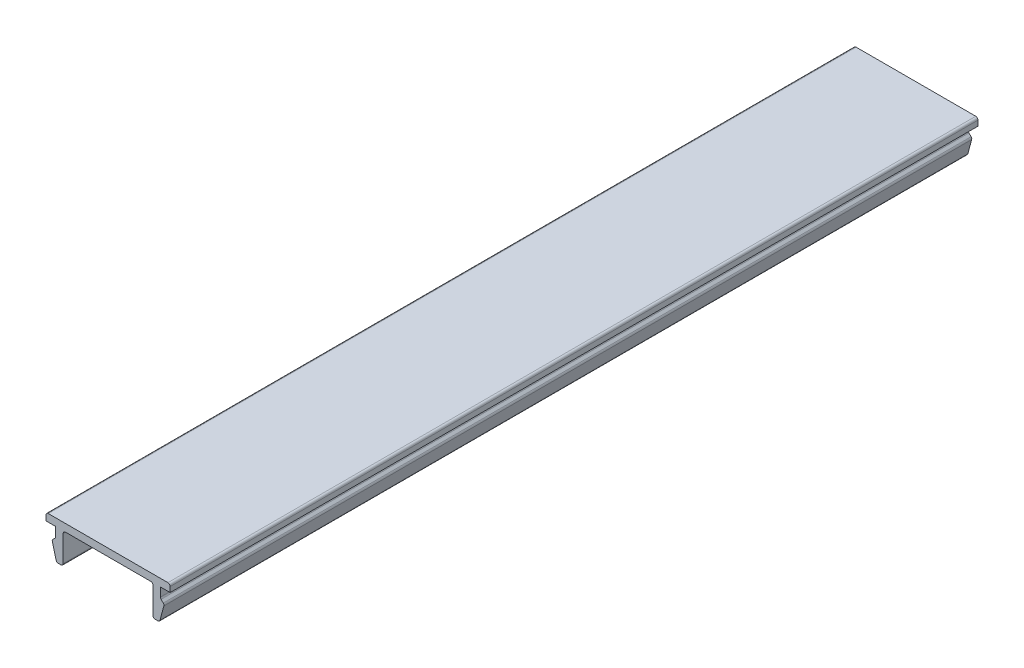
ISO-10303-21;
HEADER;
FILE_DESCRIPTION(('STEP AP214'),'2;1');
FILE_NAME('part.step','',(''),(''),'','','');
FILE_SCHEMA(('AUTOMOTIVE_DESIGN { 1 0 10303 214 1 1 1 1 }'));
ENDSEC;
DATA;
#1=APPLICATION_CONTEXT('core data for automotive mechanical design processes');
#2=APPLICATION_PROTOCOL_DEFINITION('international standard','automotive_design',2000,#1);
#3=PRODUCT_CONTEXT('',#1,'mechanical');
#4=PRODUCT('Part','Part','',(#3));
#5=PRODUCT_RELATED_PRODUCT_CATEGORY('part','',(#4));
#6=PRODUCT_DEFINITION_FORMATION('','',#4);
#7=PRODUCT_DEFINITION_CONTEXT('part definition',#1,'design');
#8=PRODUCT_DEFINITION('design','',#6,#7);
#9=PRODUCT_DEFINITION_SHAPE('','',#8);
#10=(LENGTH_UNIT() NAMED_UNIT(*) SI_UNIT(.MILLI.,.METRE.));
#11=(NAMED_UNIT(*) PLANE_ANGLE_UNIT() SI_UNIT($,.RADIAN.));
#12=(NAMED_UNIT(*) SI_UNIT($,.STERADIAN.) SOLID_ANGLE_UNIT());
#13=UNCERTAINTY_MEASURE_WITH_UNIT(LENGTH_MEASURE(1.E-05),#10,'distance_accuracy_value','');
#14=(GEOMETRIC_REPRESENTATION_CONTEXT(3) GLOBAL_UNCERTAINTY_ASSIGNED_CONTEXT((#13)) GLOBAL_UNIT_ASSIGNED_CONTEXT((#10,
#11,#12)) REPRESENTATION_CONTEXT('',''));
#15=CARTESIAN_POINT('',(0.,0.,0.));
#16=DIRECTION('',(0.,0.,1.));
#17=DIRECTION('',(1.,0.,0.));
#18=AXIS2_PLACEMENT_3D('',#15,#16,#17);
#19=CARTESIAN_POINT('',(-8.3,1.,108.));
#20=DIRECTION('',(1.,0.,0.));
#21=DIRECTION('',(0.,0.,-1.));
#22=AXIS2_PLACEMENT_3D('',#19,#20,#21);
#23=PLANE('',#22);
#24=DIRECTION('',(0.,-1.,0.));
#25=VECTOR('',#24,1.);
#26=CARTESIAN_POINT('',(-8.3,1.,108.));
#27=LINE('',#26,#25);
#28=CARTESIAN_POINT('',(-8.3,0.7,108.));
#29=VERTEX_POINT('',#28);
#30=CARTESIAN_POINT('',(-8.3,0.,108.));
#31=VERTEX_POINT('',#30);
#32=EDGE_CURVE('E224',#29,#31,#27,.T.);
#33=ORIENTED_EDGE('',*,*,#32,.F.);
#34=DIRECTION('',(0.,0.,-1.));
#35=VECTOR('',#34,1.);
#36=CARTESIAN_POINT('',(-8.3,0.7,108.));
#37=LINE('',#36,#35);
#38=CARTESIAN_POINT('',(-8.3,0.7,0.));
#39=VERTEX_POINT('',#38);
#40=EDGE_CURVE('E387',#29,#39,#37,.T.);
#41=ORIENTED_EDGE('',*,*,#40,.T.);
#42=DIRECTION('',(0.,-1.,0.));
#43=VECTOR('',#42,1.);
#44=CARTESIAN_POINT('',(-8.3,1.,0.));
#45=LINE('',#44,#43);
#46=CARTESIAN_POINT('',(-8.3,0.,0.));
#47=VERTEX_POINT('',#46);
#48=EDGE_CURVE('E252',#39,#47,#45,.T.);
#49=ORIENTED_EDGE('',*,*,#48,.T.);
#50=DIRECTION('',(0.,0.,-1.));
#51=VECTOR('',#50,1.);
#52=CARTESIAN_POINT('',(-8.3,0.,108.));
#53=LINE('',#52,#51);
#54=EDGE_CURVE('E244',#31,#47,#53,.T.);
#55=ORIENTED_EDGE('',*,*,#54,.F.);
#56=EDGE_LOOP('',(#33,#41,#49,#55));
#57=FACE_BOUND('',#56,.T.);
#58=ADVANCED_FACE('F39',(#57),#23,.F.);
#59=CARTESIAN_POINT('',(-8.3,0.,108.));
#60=DIRECTION('',(0.,1.,0.));
#61=DIRECTION('',(0.,0.,1.));
#62=AXIS2_PLACEMENT_3D('',#59,#60,#61);
#63=PLANE('',#62);
#64=DIRECTION('',(1.,0.,0.));
#65=VECTOR('',#64,1.);
#66=CARTESIAN_POINT('',(-8.3,0.,0.));
#67=LINE('',#66,#65);
#68=CARTESIAN_POINT('',(-7.,0.,0.));
#69=VERTEX_POINT('',#68);
#70=EDGE_CURVE('E422',#47,#69,#67,.T.);
#71=ORIENTED_EDGE('',*,*,#70,.T.);
#72=DIRECTION('',(0.,0.,-1.));
#73=VECTOR('',#72,1.);
#74=CARTESIAN_POINT('',(-7.,0.,108.));
#75=LINE('',#74,#73);
#76=CARTESIAN_POINT('',(-7.,0.,108.));
#77=VERTEX_POINT('',#76);
#78=EDGE_CURVE('E246',#77,#69,#75,.T.);
#79=ORIENTED_EDGE('',*,*,#78,.F.);
#80=DIRECTION('',(1.,0.,0.));
#81=VECTOR('',#80,1.);
#82=CARTESIAN_POINT('',(-8.3,0.,108.));
#83=LINE('',#82,#81);
#84=EDGE_CURVE('E229',#31,#77,#83,.T.);
#85=ORIENTED_EDGE('',*,*,#84,.F.);
#86=ORIENTED_EDGE('',*,*,#54,.T.);
#87=EDGE_LOOP('',(#71,#79,#85,#86));
#88=FACE_BOUND('',#87,.T.);
#89=ADVANCED_FACE('F243',(#88),#63,.F.);
#90=CARTESIAN_POINT('',(-7.,0.,108.));
#91=DIRECTION('',(1.,0.,0.));
#92=DIRECTION('',(0.,0.,-1.));
#93=AXIS2_PLACEMENT_3D('',#90,#91,#92);
#94=PLANE('',#93);
#95=DIRECTION('',(0.,-1.,0.));
#96=VECTOR('',#95,1.);
#97=CARTESIAN_POINT('',(-7.,0.,0.));
#98=LINE('',#97,#96);
#99=CARTESIAN_POINT('',(-7.,-1.17573593128807,0.));
#100=VERTEX_POINT('',#99);
#101=EDGE_CURVE('E413',#69,#100,#98,.T.);
#102=ORIENTED_EDGE('',*,*,#101,.T.);
#103=DIRECTION('',(0.,0.,-1.));
#104=VECTOR('',#103,1.);
#105=CARTESIAN_POINT('',(-7.,-1.17573593128807,108.));
#106=LINE('',#105,#104);
#107=CARTESIAN_POINT('',(-7.,-1.17573593128807,108.));
#108=VERTEX_POINT('',#107);
#109=EDGE_CURVE('E384',#100,#108,#106,.F.);
#110=ORIENTED_EDGE('',*,*,#109,.T.);
#111=DIRECTION('',(0.,-1.,0.));
#112=VECTOR('',#111,1.);
#113=CARTESIAN_POINT('',(-7.,0.,108.));
#114=LINE('',#113,#112);
#115=EDGE_CURVE('E249',#77,#108,#114,.T.);
#116=ORIENTED_EDGE('',*,*,#115,.F.);
#117=ORIENTED_EDGE('',*,*,#78,.T.);
#118=EDGE_LOOP('',(#102,#110,#116,#117));
#119=FACE_BOUND('',#118,.T.);
#120=ADVANCED_FACE('F420',(#119),#94,.F.);
#121=CARTESIAN_POINT('',(-7.,-1.3,108.));
#122=DIRECTION('',(0.707106781186547,-0.707106781186548,0.));
#123=DIRECTION('',(0.707106781186548,0.707106781186547,0.));
#124=AXIS2_PLACEMENT_3D('',#121,#122,#123);
#125=PLANE('',#124);
#126=DIRECTION('',(-0.707106781186548,-0.707106781186547,0.));
#127=VECTOR('',#126,1.);
#128=CARTESIAN_POINT('',(-7.,-1.3,0.));
#129=LINE('',#128,#127);
#130=CARTESIAN_POINT('',(-7.08786796564404,-1.38786796564404,0.));
#131=VERTEX_POINT('',#130);
#132=CARTESIAN_POINT('',(-7.37752551286084,-1.67752551286084,0.));
#133=VERTEX_POINT('',#132);
#134=EDGE_CURVE('E415',#131,#133,#129,.T.);
#135=ORIENTED_EDGE('',*,*,#134,.T.);
#136=DIRECTION('',(0.,0.,-1.));
#137=VECTOR('',#136,1.);
#138=CARTESIAN_POINT('',(-7.37752551286084,-1.67752551286084,108.));
#139=LINE('',#138,#137);
#140=CARTESIAN_POINT('',(-7.37752551286084,-1.67752551286084,108.));
#141=VERTEX_POINT('',#140);
#142=EDGE_CURVE('E381',#133,#141,#139,.F.);
#143=ORIENTED_EDGE('',*,*,#142,.T.);
#144=DIRECTION('',(-0.707106781186548,-0.707106781186547,0.));
#145=VECTOR('',#144,1.);
#146=CARTESIAN_POINT('',(-7.,-1.3,108.));
#147=LINE('',#146,#145);
#148=CARTESIAN_POINT('',(-7.08786796564404,-1.38786796564404,108.));
#149=VERTEX_POINT('',#148);
#150=EDGE_CURVE('E428',#149,#141,#147,.T.);
#151=ORIENTED_EDGE('',*,*,#150,.F.);
#152=DIRECTION('',(0.,0.,-1.));
#153=VECTOR('',#152,1.);
#154=CARTESIAN_POINT('',(-7.08786796564404,-1.38786796564404,0.));
#155=LINE('',#154,#153);
#156=EDGE_CURVE('E377',#149,#131,#155,.T.);
#157=ORIENTED_EDGE('',*,*,#156,.T.);
#158=EDGE_LOOP('',(#135,#143,#151,#157));
#159=FACE_BOUND('',#158,.T.);
#160=ADVANCED_FACE('F431',(#159),#125,.F.);
#161=CARTESIAN_POINT('',(-7.5,-1.8,108.));
#162=DIRECTION('',(0.965925826289068,0.258819045102522,0.));
#163=DIRECTION('',(-0.258819045102522,0.965925826289068,0.));
#164=AXIS2_PLACEMENT_3D('',#161,#162,#163);
#165=PLANE('',#164);
#166=DIRECTION('',(0.258819045102522,-0.965925826289068,0.));
#167=VECTOR('',#166,1.);
#168=CARTESIAN_POINT('',(-7.5,-1.8,0.));
#169=LINE('',#168,#167);
#170=CARTESIAN_POINT('',(-7.4551712263916,-1.96730326074756,0.));
#171=VERTEX_POINT('',#170);
#172=CARTESIAN_POINT('',(-6.94329650890145,-3.87764571353076,0.));
#173=VERTEX_POINT('',#172);
#174=EDGE_CURVE('E488',#171,#173,#169,.T.);
#175=ORIENTED_EDGE('',*,*,#174,.T.);
#176=DIRECTION('',(0.,0.,-1.));
#177=VECTOR('',#176,1.);
#178=CARTESIAN_POINT('',(-6.94329650890145,-3.87764571353076,108.));
#179=LINE('',#178,#177);
#180=CARTESIAN_POINT('',(-6.94329650890145,-3.87764571353076,108.));
#181=VERTEX_POINT('',#180);
#182=EDGE_CURVE('E374',#173,#181,#179,.F.);
#183=ORIENTED_EDGE('',*,*,#182,.T.);
#184=DIRECTION('',(0.258819045102522,-0.965925826289068,0.));
#185=VECTOR('',#184,1.);
#186=CARTESIAN_POINT('',(-7.5,-1.8,108.));
#187=LINE('',#186,#185);
#188=CARTESIAN_POINT('',(-7.4551712263916,-1.96730326074756,108.));
#189=VERTEX_POINT('',#188);
#190=EDGE_CURVE('E434',#189,#181,#187,.T.);
#191=ORIENTED_EDGE('',*,*,#190,.F.);
#192=DIRECTION('',(0.,0.,-1.));
#193=VECTOR('',#192,1.);
#194=CARTESIAN_POINT('',(-7.4551712263916,-1.96730326074756,108.));
#195=LINE('',#194,#193);
#196=EDGE_CURVE('E370',#189,#171,#195,.T.);
#197=ORIENTED_EDGE('',*,*,#196,.T.);
#198=EDGE_LOOP('',(#175,#183,#191,#197));
#199=FACE_BOUND('',#198,.T.);
#200=ADVANCED_FACE('F613',(#199),#165,.F.);
#201=CARTESIAN_POINT('',(-6.,-4.1,108.));
#202=DIRECTION('',(0.,1.,0.));
#203=DIRECTION('',(0.,0.,1.));
#204=AXIS2_PLACEMENT_3D('',#201,#202,#203);
#205=PLANE('',#204);
#206=DIRECTION('',(1.,0.,0.));
#207=VECTOR('',#206,1.);
#208=CARTESIAN_POINT('',(-6.,-4.1,0.));
#209=LINE('',#208,#207);
#210=CARTESIAN_POINT('',(-6.65351876101473,-4.1,0.));
#211=VERTEX_POINT('',#210);
#212=CARTESIAN_POINT('',(-6.3,-4.1,0.));
#213=VERTEX_POINT('',#212);
#214=EDGE_CURVE('E492',#211,#213,#209,.T.);
#215=ORIENTED_EDGE('',*,*,#214,.T.);
#216=DIRECTION('',(0.,0.,-1.));
#217=VECTOR('',#216,1.);
#218=CARTESIAN_POINT('',(-6.3,-4.1,108.));
#219=LINE('',#218,#217);
#220=CARTESIAN_POINT('',(-6.3,-4.1,108.));
#221=VERTEX_POINT('',#220);
#222=EDGE_CURVE('E367',#213,#221,#219,.F.);
#223=ORIENTED_EDGE('',*,*,#222,.T.);
#224=DIRECTION('',(1.,0.,0.));
#225=VECTOR('',#224,1.);
#226=CARTESIAN_POINT('',(-6.,-4.1,108.));
#227=LINE('',#226,#225);
#228=CARTESIAN_POINT('',(-6.65351876101473,-4.1,108.));
#229=VERTEX_POINT('',#228);
#230=EDGE_CURVE('E439',#229,#221,#227,.T.);
#231=ORIENTED_EDGE('',*,*,#230,.F.);
#232=DIRECTION('',(0.,0.,-1.));
#233=VECTOR('',#232,1.);
#234=CARTESIAN_POINT('',(-6.65351876101473,-4.1,108.));
#235=LINE('',#234,#233);
#236=EDGE_CURVE('E363',#229,#211,#235,.T.);
#237=ORIENTED_EDGE('',*,*,#236,.T.);
#238=EDGE_LOOP('',(#215,#223,#231,#237));
#239=FACE_BOUND('',#238,.T.);
#240=ADVANCED_FACE('F620',(#239),#205,.F.);
#241=CARTESIAN_POINT('',(-6.,0.,108.));
#242=DIRECTION('',(-1.,0.,0.));
#243=DIRECTION('',(0.,-1.,0.));
#244=AXIS2_PLACEMENT_3D('',#241,#242,#243);
#245=PLANE('',#244);
#246=DIRECTION('',(0.,1.,0.));
#247=VECTOR('',#246,1.);
#248=CARTESIAN_POINT('',(-6.,0.,0.));
#249=LINE('',#248,#247);
#250=CARTESIAN_POINT('',(-6.,-3.8,0.));
#251=VERTEX_POINT('',#250);
#252=CARTESIAN_POINT('',(-6.,-0.3,0.));
#253=VERTEX_POINT('',#252);
#254=EDGE_CURVE('E496',#251,#253,#249,.T.);
#255=ORIENTED_EDGE('',*,*,#254,.T.);
#256=DIRECTION('',(0.,0.,-1.));
#257=VECTOR('',#256,1.);
#258=CARTESIAN_POINT('',(-6.,-0.3,108.));
#259=LINE('',#258,#257);
#260=CARTESIAN_POINT('',(-6.,-0.3,108.));
#261=VERTEX_POINT('',#260);
#262=EDGE_CURVE('E360',#253,#261,#259,.F.);
#263=ORIENTED_EDGE('',*,*,#262,.T.);
#264=DIRECTION('',(0.,1.,0.));
#265=VECTOR('',#264,1.);
#266=CARTESIAN_POINT('',(-6.,0.,108.));
#267=LINE('',#266,#265);
#268=CARTESIAN_POINT('',(-6.,-3.8,108.));
#269=VERTEX_POINT('',#268);
#270=EDGE_CURVE('E446',#269,#261,#267,.T.);
#271=ORIENTED_EDGE('',*,*,#270,.F.);
#272=DIRECTION('',(0.,0.,-1.));
#273=VECTOR('',#272,1.);
#274=CARTESIAN_POINT('',(-6.,-3.8,108.));
#275=LINE('',#274,#273);
#276=EDGE_CURVE('E356',#269,#251,#275,.T.);
#277=ORIENTED_EDGE('',*,*,#276,.T.);
#278=EDGE_LOOP('',(#255,#263,#271,#277));
#279=FACE_BOUND('',#278,.T.);
#280=ADVANCED_FACE('F627',(#279),#245,.F.);
#281=CARTESIAN_POINT('',(-6.,0.,108.));
#282=DIRECTION('',(0.,1.,0.));
#283=DIRECTION('',(0.,0.,1.));
#284=AXIS2_PLACEMENT_3D('',#281,#282,#283);
#285=PLANE('',#284);
#286=DIRECTION('',(1.,0.,0.));
#287=VECTOR('',#286,1.);
#288=CARTESIAN_POINT('',(-6.,0.,0.));
#289=LINE('',#288,#287);
#290=CARTESIAN_POINT('',(-5.7,0.,0.));
#291=VERTEX_POINT('',#290);
#292=CARTESIAN_POINT('',(5.69999999999999,0.,0.));
#293=VERTEX_POINT('',#292);
#294=EDGE_CURVE('E500',#291,#293,#289,.T.);
#295=ORIENTED_EDGE('',*,*,#294,.T.);
#296=DIRECTION('',(0.,0.,-1.));
#297=VECTOR('',#296,1.);
#298=CARTESIAN_POINT('',(5.69999999999999,0.,108.));
#299=LINE('',#298,#297);
#300=CARTESIAN_POINT('',(5.69999999999999,0.,108.));
#301=VERTEX_POINT('',#300);
#302=EDGE_CURVE('E353',#293,#301,#299,.F.);
#303=ORIENTED_EDGE('',*,*,#302,.T.);
#304=DIRECTION('',(1.,0.,0.));
#305=VECTOR('',#304,1.);
#306=CARTESIAN_POINT('',(-6.,0.,108.));
#307=LINE('',#306,#305);
#308=CARTESIAN_POINT('',(-5.7,0.,108.));
#309=VERTEX_POINT('',#308);
#310=EDGE_CURVE('E450',#309,#301,#307,.T.);
#311=ORIENTED_EDGE('',*,*,#310,.F.);
#312=DIRECTION('',(0.,0.,-1.));
#313=VECTOR('',#312,1.);
#314=CARTESIAN_POINT('',(-5.7,0.,0.));
#315=LINE('',#314,#313);
#316=EDGE_CURVE('E349',#309,#291,#315,.T.);
#317=ORIENTED_EDGE('',*,*,#316,.T.);
#318=EDGE_LOOP('',(#295,#303,#311,#317));
#319=FACE_BOUND('',#318,.T.);
#320=ADVANCED_FACE('F634',(#319),#285,.F.);
#321=CARTESIAN_POINT('',(5.99999999999999,0.,108.));
#322=DIRECTION('',(1.,0.,0.));
#323=DIRECTION('',(0.,1.,0.));
#324=AXIS2_PLACEMENT_3D('',#321,#322,#323);
#325=PLANE('',#324);
#326=DIRECTION('',(0.,-1.,0.));
#327=VECTOR('',#326,1.);
#328=CARTESIAN_POINT('',(5.99999999999999,0.,0.));
#329=LINE('',#328,#327);
#330=CARTESIAN_POINT('',(5.99999999999999,-0.3,0.));
#331=VERTEX_POINT('',#330);
#332=CARTESIAN_POINT('',(5.99999999999999,-3.8,0.));
#333=VERTEX_POINT('',#332);
#334=EDGE_CURVE('E504',#331,#333,#329,.T.);
#335=ORIENTED_EDGE('',*,*,#334,.T.);
#336=DIRECTION('',(0.,0.,-1.));
#337=VECTOR('',#336,1.);
#338=CARTESIAN_POINT('',(5.99999999999999,-3.8,108.));
#339=LINE('',#338,#337);
#340=CARTESIAN_POINT('',(5.99999999999999,-3.8,108.));
#341=VERTEX_POINT('',#340);
#342=EDGE_CURVE('E346',#333,#341,#339,.F.);
#343=ORIENTED_EDGE('',*,*,#342,.T.);
#344=DIRECTION('',(0.,-1.,0.));
#345=VECTOR('',#344,1.);
#346=CARTESIAN_POINT('',(5.99999999999999,0.,108.));
#347=LINE('',#346,#345);
#348=CARTESIAN_POINT('',(5.99999999999999,-0.3,108.));
#349=VERTEX_POINT('',#348);
#350=EDGE_CURVE('E454',#349,#341,#347,.T.);
#351=ORIENTED_EDGE('',*,*,#350,.F.);
#352=DIRECTION('',(0.,0.,-1.));
#353=VECTOR('',#352,1.);
#354=CARTESIAN_POINT('',(5.99999999999999,-0.3,0.));
#355=LINE('',#354,#353);
#356=EDGE_CURVE('E342',#349,#331,#355,.T.);
#357=ORIENTED_EDGE('',*,*,#356,.T.);
#358=EDGE_LOOP('',(#335,#343,#351,#357));
#359=FACE_BOUND('',#358,.T.);
#360=ADVANCED_FACE('F641',(#359),#325,.F.);
#361=CARTESIAN_POINT('',(5.99999999999999,-4.1,108.));
#362=DIRECTION('',(0.,1.,0.));
#363=DIRECTION('',(0.,0.,1.));
#364=AXIS2_PLACEMENT_3D('',#361,#362,#363);
#365=PLANE('',#364);
#366=DIRECTION('',(1.,0.,0.));
#367=VECTOR('',#366,1.);
#368=CARTESIAN_POINT('',(5.99999999999999,-4.1,0.));
#369=LINE('',#368,#367);
#370=CARTESIAN_POINT('',(6.29999999999999,-4.1,0.));
#371=VERTEX_POINT('',#370);
#372=CARTESIAN_POINT('',(6.65351876101472,-4.1,0.));
#373=VERTEX_POINT('',#372);
#374=EDGE_CURVE('E508',#371,#373,#369,.T.);
#375=ORIENTED_EDGE('',*,*,#374,.T.);
#376=DIRECTION('',(0.,0.,-1.));
#377=VECTOR('',#376,1.);
#378=CARTESIAN_POINT('',(6.65351876101472,-4.1,108.));
#379=LINE('',#378,#377);
#380=CARTESIAN_POINT('',(6.65351876101472,-4.1,108.));
#381=VERTEX_POINT('',#380);
#382=EDGE_CURVE('E339',#373,#381,#379,.F.);
#383=ORIENTED_EDGE('',*,*,#382,.T.);
#384=DIRECTION('',(1.,0.,0.));
#385=VECTOR('',#384,1.);
#386=CARTESIAN_POINT('',(5.99999999999999,-4.1,108.));
#387=LINE('',#386,#385);
#388=CARTESIAN_POINT('',(6.29999999999999,-4.1,108.));
#389=VERTEX_POINT('',#388);
#390=EDGE_CURVE('E458',#389,#381,#387,.T.);
#391=ORIENTED_EDGE('',*,*,#390,.F.);
#392=DIRECTION('',(0.,0.,-1.));
#393=VECTOR('',#392,1.);
#394=CARTESIAN_POINT('',(6.29999999999999,-4.1,108.));
#395=LINE('',#394,#393);
#396=EDGE_CURVE('E335',#389,#371,#395,.T.);
#397=ORIENTED_EDGE('',*,*,#396,.T.);
#398=EDGE_LOOP('',(#375,#383,#391,#397));
#399=FACE_BOUND('',#398,.T.);
#400=ADVANCED_FACE('F648',(#399),#365,.F.);
#401=CARTESIAN_POINT('',(7.49999999999999,-1.8,108.));
#402=DIRECTION('',(-0.965925826289068,0.258819045102522,0.));
#403=DIRECTION('',(-0.258819045102522,-0.965925826289068,0.));
#404=AXIS2_PLACEMENT_3D('',#401,#402,#403);
#405=PLANE('',#404);
#406=DIRECTION('',(0.258819045102522,0.965925826289068,0.));
#407=VECTOR('',#406,1.);
#408=CARTESIAN_POINT('',(7.49999999999999,-1.8,0.));
#409=LINE('',#408,#407);
#410=CARTESIAN_POINT('',(6.94329650890144,-3.87764571353075,0.));
#411=VERTEX_POINT('',#410);
#412=CARTESIAN_POINT('',(7.45517122639159,-1.96730326074756,0.));
#413=VERTEX_POINT('',#412);
#414=EDGE_CURVE('E512',#411,#413,#409,.T.);
#415=ORIENTED_EDGE('',*,*,#414,.T.);
#416=DIRECTION('',(0.,0.,-1.));
#417=VECTOR('',#416,1.);
#418=CARTESIAN_POINT('',(7.45517122639159,-1.96730326074756,108.));
#419=LINE('',#418,#417);
#420=CARTESIAN_POINT('',(7.45517122639159,-1.96730326074756,108.));
#421=VERTEX_POINT('',#420);
#422=EDGE_CURVE('E332',#413,#421,#419,.F.);
#423=ORIENTED_EDGE('',*,*,#422,.T.);
#424=DIRECTION('',(0.258819045102522,0.965925826289068,0.));
#425=VECTOR('',#424,1.);
#426=CARTESIAN_POINT('',(7.49999999999999,-1.8,108.));
#427=LINE('',#426,#425);
#428=CARTESIAN_POINT('',(6.94329650890144,-3.87764571353075,108.));
#429=VERTEX_POINT('',#428);
#430=EDGE_CURVE('E462',#429,#421,#427,.T.);
#431=ORIENTED_EDGE('',*,*,#430,.F.);
#432=DIRECTION('',(0.,0.,-1.));
#433=VECTOR('',#432,1.);
#434=CARTESIAN_POINT('',(6.94329650890144,-3.87764571353075,108.));
#435=LINE('',#434,#433);
#436=EDGE_CURVE('E328',#429,#411,#435,.T.);
#437=ORIENTED_EDGE('',*,*,#436,.T.);
#438=EDGE_LOOP('',(#415,#423,#431,#437));
#439=FACE_BOUND('',#438,.T.);
#440=ADVANCED_FACE('F655',(#439),#405,.F.);
#441=CARTESIAN_POINT('',(6.99999999999999,-1.3,108.));
#442=DIRECTION('',(-0.707106781186547,-0.707106781186548,0.));
#443=DIRECTION('',(0.707106781186548,-0.707106781186547,0.));
#444=AXIS2_PLACEMENT_3D('',#441,#442,#443);
#445=PLANE('',#444);
#446=DIRECTION('',(-0.707106781186548,0.707106781186547,0.));
#447=VECTOR('',#446,1.);
#448=CARTESIAN_POINT('',(6.99999999999999,-1.3,0.));
#449=LINE('',#448,#447);
#450=CARTESIAN_POINT('',(7.37752551286083,-1.67752551286084,0.));
#451=VERTEX_POINT('',#450);
#452=CARTESIAN_POINT('',(7.08786796564403,-1.38786796564403,0.));
#453=VERTEX_POINT('',#452);
#454=EDGE_CURVE('E516',#451,#453,#449,.T.);
#455=ORIENTED_EDGE('',*,*,#454,.T.);
#456=DIRECTION('',(0.,0.,-1.));
#457=VECTOR('',#456,1.);
#458=CARTESIAN_POINT('',(7.08786796564403,-1.38786796564403,108.));
#459=LINE('',#458,#457);
#460=CARTESIAN_POINT('',(7.08786796564403,-1.38786796564403,108.));
#461=VERTEX_POINT('',#460);
#462=EDGE_CURVE('E63',#453,#461,#459,.F.);
#463=ORIENTED_EDGE('',*,*,#462,.T.);
#464=DIRECTION('',(-0.707106781186548,0.707106781186547,0.));
#465=VECTOR('',#464,1.);
#466=CARTESIAN_POINT('',(6.99999999999999,-1.3,108.));
#467=LINE('',#466,#465);
#468=CARTESIAN_POINT('',(7.37752551286083,-1.67752551286084,108.));
#469=VERTEX_POINT('',#468);
#470=EDGE_CURVE('E466',#469,#461,#467,.T.);
#471=ORIENTED_EDGE('',*,*,#470,.F.);
#472=DIRECTION('',(0.,0.,-1.));
#473=VECTOR('',#472,1.);
#474=CARTESIAN_POINT('',(7.37752551286083,-1.67752551286084,108.));
#475=LINE('',#474,#473);
#476=EDGE_CURVE('E322',#469,#451,#475,.T.);
#477=ORIENTED_EDGE('',*,*,#476,.T.);
#478=EDGE_LOOP('',(#455,#463,#471,#477));
#479=FACE_BOUND('',#478,.T.);
#480=ADVANCED_FACE('F659',(#479),#445,.F.);
#481=CARTESIAN_POINT('',(6.99999999999999,0.,108.));
#482=DIRECTION('',(-1.,0.,0.));
#483=DIRECTION('',(0.,0.,1.));
#484=AXIS2_PLACEMENT_3D('',#481,#482,#483);
#485=PLANE('',#484);
#486=DIRECTION('',(0.,1.,0.));
#487=VECTOR('',#486,1.);
#488=CARTESIAN_POINT('',(6.99999999999999,0.,108.));
#489=LINE('',#488,#487);
#490=CARTESIAN_POINT('',(6.99999999999999,-1.17573593128807,108.));
#491=VERTEX_POINT('',#490);
#492=CARTESIAN_POINT('',(6.99999999999999,0.,108.));
#493=VERTEX_POINT('',#492);
#494=EDGE_CURVE('E469',#491,#493,#489,.T.);
#495=ORIENTED_EDGE('',*,*,#494,.F.);
#496=DIRECTION('',(0.,0.,-1.));
#497=VECTOR('',#496,1.);
#498=CARTESIAN_POINT('',(6.99999999999999,-1.17573593128807,0.));
#499=LINE('',#498,#497);
#500=CARTESIAN_POINT('',(6.99999999999999,-1.17573593128807,0.));
#501=VERTEX_POINT('',#500);
#502=EDGE_CURVE('E318',#491,#501,#499,.T.);
#503=ORIENTED_EDGE('',*,*,#502,.T.);
#504=DIRECTION('',(0.,1.,0.));
#505=VECTOR('',#504,1.);
#506=CARTESIAN_POINT('',(6.99999999999999,0.,0.));
#507=LINE('',#506,#505);
#508=CARTESIAN_POINT('',(6.99999999999999,0.,0.));
#509=VERTEX_POINT('',#508);
#510=EDGE_CURVE('E519',#501,#509,#507,.T.);
#511=ORIENTED_EDGE('',*,*,#510,.T.);
#512=DIRECTION('',(0.,0.,-1.));
#513=VECTOR('',#512,1.);
#514=CARTESIAN_POINT('',(6.99999999999999,0.,108.));
#515=LINE('',#514,#513);
#516=EDGE_CURVE('E261',#493,#509,#515,.T.);
#517=ORIENTED_EDGE('',*,*,#516,.F.);
#518=EDGE_LOOP('',(#495,#503,#511,#517));
#519=FACE_BOUND('',#518,.T.);
#520=ADVANCED_FACE('F662',(#519),#485,.F.);
#521=CARTESIAN_POINT('',(6.99999999999999,0.,108.));
#522=DIRECTION('',(0.,1.,0.));
#523=DIRECTION('',(0.,0.,1.));
#524=AXIS2_PLACEMENT_3D('',#521,#522,#523);
#525=PLANE('',#524);
#526=DIRECTION('',(1.,0.,0.));
#527=VECTOR('',#526,1.);
#528=CARTESIAN_POINT('',(6.99999999999999,0.,0.));
#529=LINE('',#528,#527);
#530=CARTESIAN_POINT('',(8.3,0.,0.));
#531=VERTEX_POINT('',#530);
#532=EDGE_CURVE('E522',#509,#531,#529,.T.);
#533=ORIENTED_EDGE('',*,*,#532,.T.);
#534=DIRECTION('',(0.,0.,-1.));
#535=VECTOR('',#534,1.);
#536=CARTESIAN_POINT('',(8.3,0.,108.));
#537=LINE('',#536,#535);
#538=CARTESIAN_POINT('',(8.3,0.,108.));
#539=VERTEX_POINT('',#538);
#540=EDGE_CURVE('E481',#539,#531,#537,.T.);
#541=ORIENTED_EDGE('',*,*,#540,.F.);
#542=DIRECTION('',(1.,0.,0.));
#543=VECTOR('',#542,1.);
#544=CARTESIAN_POINT('',(6.99999999999999,0.,108.));
#545=LINE('',#544,#543);
#546=EDGE_CURVE('E472',#493,#539,#545,.T.);
#547=ORIENTED_EDGE('',*,*,#546,.F.);
#548=ORIENTED_EDGE('',*,*,#516,.T.);
#549=EDGE_LOOP('',(#533,#541,#547,#548));
#550=FACE_BOUND('',#549,.T.);
#551=ADVANCED_FACE('F540',(#550),#525,.F.);
#552=CARTESIAN_POINT('',(8.3,1.,108.));
#553=DIRECTION('',(-1.,0.,0.));
#554=DIRECTION('',(0.,0.,1.));
#555=AXIS2_PLACEMENT_3D('',#552,#553,#554);
#556=PLANE('',#555);
#557=DIRECTION('',(0.,1.,0.));
#558=VECTOR('',#557,1.);
#559=CARTESIAN_POINT('',(8.3,1.,0.));
#560=LINE('',#559,#558);
#561=CARTESIAN_POINT('',(8.3,0.700000000000004,0.));
#562=VERTEX_POINT('',#561);
#563=EDGE_CURVE('E525',#531,#562,#560,.T.);
#564=ORIENTED_EDGE('',*,*,#563,.T.);
#565=DIRECTION('',(0.,0.,-1.));
#566=VECTOR('',#565,1.);
#567=CARTESIAN_POINT('',(8.3,0.700000000000004,108.));
#568=LINE('',#567,#566);
#569=CARTESIAN_POINT('',(8.3,0.700000000000004,108.));
#570=VERTEX_POINT('',#569);
#571=EDGE_CURVE('E292',#562,#570,#568,.F.);
#572=ORIENTED_EDGE('',*,*,#571,.T.);
#573=DIRECTION('',(0.,1.,0.));
#574=VECTOR('',#573,1.);
#575=CARTESIAN_POINT('',(8.3,1.,108.));
#576=LINE('',#575,#574);
#577=EDGE_CURVE('E475',#539,#570,#576,.T.);
#578=ORIENTED_EDGE('',*,*,#577,.F.);
#579=ORIENTED_EDGE('',*,*,#540,.T.);
#580=EDGE_LOOP('',(#564,#572,#578,#579));
#581=FACE_BOUND('',#580,.T.);
#582=ADVANCED_FACE('F547',(#581),#556,.F.);
#583=CARTESIAN_POINT('',(-8.3,1.,108.));
#584=DIRECTION('',(0.,-1.,0.));
#585=DIRECTION('',(1.,0.,0.));
#586=AXIS2_PLACEMENT_3D('',#583,#584,#585);
#587=PLANE('',#586);
#588=DIRECTION('',(-1.,0.,0.));
#589=VECTOR('',#588,1.);
#590=CARTESIAN_POINT('',(-8.3,1.,108.));
#591=LINE('',#590,#589);
#592=CARTESIAN_POINT('',(7.99999999999999,1.,108.));
#593=VERTEX_POINT('',#592);
#594=CARTESIAN_POINT('',(-8.,1.,108.));
#595=VERTEX_POINT('',#594);
#596=EDGE_CURVE('E478',#593,#595,#591,.T.);
#597=ORIENTED_EDGE('',*,*,#596,.F.);
#598=DIRECTION('',(0.,0.,-1.));
#599=VECTOR('',#598,1.);
#600=CARTESIAN_POINT('',(8.,1.,108.));
#601=LINE('',#600,#599);
#602=CARTESIAN_POINT('',(7.99999999999999,1.,0.));
#603=VERTEX_POINT('',#602);
#604=EDGE_CURVE('E259',#593,#603,#601,.T.);
#605=ORIENTED_EDGE('',*,*,#604,.T.);
#606=DIRECTION('',(-1.,0.,0.));
#607=VECTOR('',#606,1.);
#608=CARTESIAN_POINT('',(-8.3,1.,0.));
#609=LINE('',#608,#607);
#610=CARTESIAN_POINT('',(-8.,1.,0.));
#611=VERTEX_POINT('',#610);
#612=EDGE_CURVE('E239',#603,#611,#609,.T.);
#613=ORIENTED_EDGE('',*,*,#612,.T.);
#614=DIRECTION('',(0.,0.,-1.));
#615=VECTOR('',#614,1.);
#616=CARTESIAN_POINT('',(-8.,1.,108.));
#617=LINE('',#616,#615);
#618=EDGE_CURVE('E255',#611,#595,#617,.F.);
#619=ORIENTED_EDGE('',*,*,#618,.T.);
#620=EDGE_LOOP('',(#597,#605,#613,#619));
#621=FACE_BOUND('',#620,.T.);
#622=ADVANCED_FACE('F555',(#621),#587,.F.);
#623=CARTESIAN_POINT('',(0.,0.,108.));
#624=DIRECTION('',(0.,0.,1.));
#625=DIRECTION('',(1.,0.,0.));
#626=AXIS2_PLACEMENT_3D('',#623,#624,#625);
#627=PLANE('',#626);
#628=ORIENTED_EDGE('',*,*,#577,.T.);
#629=CARTESIAN_POINT('',(8.,0.700000000000004,108.));
#630=DIRECTION('',(0.,0.,1.));
#631=DIRECTION('',(1.,0.,0.));
#632=AXIS2_PLACEMENT_3D('',#629,#630,#631);
#633=CIRCLE('',#632,0.3);
#634=EDGE_CURVE('E315',#570,#593,#633,.T.);
#635=ORIENTED_EDGE('',*,*,#634,.T.);
#636=ORIENTED_EDGE('',*,*,#596,.T.);
#637=CARTESIAN_POINT('',(-8.,0.7,108.));
#638=DIRECTION('',(0.,0.,1.));
#639=DIRECTION('',(1.,0.,0.));
#640=AXIS2_PLACEMENT_3D('',#637,#638,#639);
#641=CIRCLE('',#640,0.3);
#642=EDGE_CURVE('E233',#595,#29,#641,.T.);
#643=ORIENTED_EDGE('',*,*,#642,.T.);
#644=ORIENTED_EDGE('',*,*,#32,.T.);
#645=ORIENTED_EDGE('',*,*,#84,.T.);
#646=ORIENTED_EDGE('',*,*,#115,.T.);
#647=CARTESIAN_POINT('',(-7.3,-1.17573593128807,108.));
#648=DIRECTION('',(0.,0.,1.));
#649=DIRECTION('',(1.,0.,0.));
#650=AXIS2_PLACEMENT_3D('',#647,#648,#649);
#651=CIRCLE('',#650,0.3);
#652=EDGE_CURVE('E11',#108,#149,#651,.F.);
#653=ORIENTED_EDGE('',*,*,#652,.T.);
#654=ORIENTED_EDGE('',*,*,#150,.T.);
#655=CARTESIAN_POINT('',(-7.16539347850488,-1.8896575472168,108.));
#656=DIRECTION('',(0.,0.,1.));
#657=DIRECTION('',(1.,0.,0.));
#658=AXIS2_PLACEMENT_3D('',#655,#656,#657);
#659=CIRCLE('',#658,0.3);
#660=EDGE_CURVE('E297',#141,#189,#659,.T.);
#661=ORIENTED_EDGE('',*,*,#660,.T.);
#662=ORIENTED_EDGE('',*,*,#190,.T.);
#663=CARTESIAN_POINT('',(-6.65351876101473,-3.8,108.));
#664=DIRECTION('',(0.,0.,1.));
#665=DIRECTION('',(1.,0.,0.));
#666=AXIS2_PLACEMENT_3D('',#663,#664,#665);
#667=CIRCLE('',#666,0.3);
#668=EDGE_CURVE('E300',#181,#229,#667,.T.);
#669=ORIENTED_EDGE('',*,*,#668,.T.);
#670=ORIENTED_EDGE('',*,*,#230,.T.);
#671=CARTESIAN_POINT('',(-6.3,-3.8,108.));
#672=DIRECTION('',(0.,0.,1.));
#673=DIRECTION('',(1.,0.,0.));
#674=AXIS2_PLACEMENT_3D('',#671,#672,#673);
#675=CIRCLE('',#674,0.3);
#676=EDGE_CURVE('E303',#221,#269,#675,.T.);
#677=ORIENTED_EDGE('',*,*,#676,.T.);
#678=ORIENTED_EDGE('',*,*,#270,.T.);
#679=CARTESIAN_POINT('',(-5.7,-0.3,108.));
#680=DIRECTION('',(0.,0.,1.));
#681=DIRECTION('',(1.,0.,0.));
#682=AXIS2_PLACEMENT_3D('',#679,#680,#681);
#683=CIRCLE('',#682,0.3);
#684=EDGE_CURVE('E404',#261,#309,#683,.F.);
#685=ORIENTED_EDGE('',*,*,#684,.T.);
#686=ORIENTED_EDGE('',*,*,#310,.T.);
#687=CARTESIAN_POINT('',(5.69999999999999,-0.3,108.));
#688=DIRECTION('',(0.,0.,1.));
#689=DIRECTION('',(1.,0.,0.));
#690=AXIS2_PLACEMENT_3D('',#687,#688,#689);
#691=CIRCLE('',#690,0.3);
#692=EDGE_CURVE('E398',#301,#349,#691,.F.);
#693=ORIENTED_EDGE('',*,*,#692,.T.);
#694=ORIENTED_EDGE('',*,*,#350,.T.);
#695=CARTESIAN_POINT('',(6.29999999999999,-3.8,108.));
#696=DIRECTION('',(0.,0.,1.));
#697=DIRECTION('',(1.,0.,0.));
#698=AXIS2_PLACEMENT_3D('',#695,#696,#697);
#699=CIRCLE('',#698,0.3);
#700=EDGE_CURVE('E306',#341,#389,#699,.T.);
#701=ORIENTED_EDGE('',*,*,#700,.T.);
#702=ORIENTED_EDGE('',*,*,#390,.T.);
#703=CARTESIAN_POINT('',(6.65351876101472,-3.8,108.));
#704=DIRECTION('',(0.,0.,1.));
#705=DIRECTION('',(1.,0.,0.));
#706=AXIS2_PLACEMENT_3D('',#703,#704,#705);
#707=CIRCLE('',#706,0.3);
#708=EDGE_CURVE('E309',#381,#429,#707,.T.);
#709=ORIENTED_EDGE('',*,*,#708,.T.);
#710=ORIENTED_EDGE('',*,*,#430,.T.);
#711=CARTESIAN_POINT('',(7.16539347850487,-1.8896575472168,108.));
#712=DIRECTION('',(0.,0.,1.));
#713=DIRECTION('',(1.,0.,0.));
#714=AXIS2_PLACEMENT_3D('',#711,#712,#713);
#715=CIRCLE('',#714,0.3);
#716=EDGE_CURVE('E312',#421,#469,#715,.T.);
#717=ORIENTED_EDGE('',*,*,#716,.T.);
#718=ORIENTED_EDGE('',*,*,#470,.T.);
#719=CARTESIAN_POINT('',(7.29999999999999,-1.17573593128807,108.));
#720=DIRECTION('',(0.,0.,1.));
#721=DIRECTION('',(1.,0.,0.));
#722=AXIS2_PLACEMENT_3D('',#719,#720,#721);
#723=CIRCLE('',#722,0.3);
#724=EDGE_CURVE('E55',#461,#491,#723,.F.);
#725=ORIENTED_EDGE('',*,*,#724,.T.);
#726=ORIENTED_EDGE('',*,*,#494,.T.);
#727=ORIENTED_EDGE('',*,*,#546,.T.);
#728=EDGE_LOOP('',(#628,#635,#636,#643,#644,#645,#646,#653,#654,#661,#662,#669,#670,#677,#678,
#685,#686,#693,#694,#701,#702,#709,#710,#717,#718,#725,#726,#727));
#729=FACE_BOUND('',#728,.T.);
#730=ADVANCED_FACE('F227',(#729),#627,.T.);
#731=CARTESIAN_POINT('',(0.,0.,0.));
#732=DIRECTION('',(0.,0.,1.));
#733=DIRECTION('',(1.,0.,0.));
#734=AXIS2_PLACEMENT_3D('',#731,#732,#733);
#735=PLANE('',#734);
#736=ORIENTED_EDGE('',*,*,#612,.F.);
#737=CARTESIAN_POINT('',(8.,0.700000000000004,0.));
#738=DIRECTION('',(0.,0.,1.));
#739=DIRECTION('',(1.,0.,0.));
#740=AXIS2_PLACEMENT_3D('',#737,#738,#739);
#741=CIRCLE('',#740,0.3);
#742=EDGE_CURVE('E289',#603,#562,#741,.F.);
#743=ORIENTED_EDGE('',*,*,#742,.T.);
#744=ORIENTED_EDGE('',*,*,#563,.F.);
#745=ORIENTED_EDGE('',*,*,#532,.F.);
#746=ORIENTED_EDGE('',*,*,#510,.F.);
#747=CARTESIAN_POINT('',(7.29999999999999,-1.17573593128807,0.));
#748=DIRECTION('',(0.,0.,1.));
#749=DIRECTION('',(1.,0.,0.));
#750=AXIS2_PLACEMENT_3D('',#747,#748,#749);
#751=CIRCLE('',#750,0.3);
#752=EDGE_CURVE('E390',#501,#453,#751,.T.);
#753=ORIENTED_EDGE('',*,*,#752,.T.);
#754=ORIENTED_EDGE('',*,*,#454,.F.);
#755=CARTESIAN_POINT('',(7.16539347850487,-1.8896575472168,0.));
#756=DIRECTION('',(0.,0.,1.));
#757=DIRECTION('',(1.,0.,0.));
#758=AXIS2_PLACEMENT_3D('',#755,#756,#757);
#759=CIRCLE('',#758,0.3);
#760=EDGE_CURVE('E286',#451,#413,#759,.F.);
#761=ORIENTED_EDGE('',*,*,#760,.T.);
#762=ORIENTED_EDGE('',*,*,#414,.F.);
#763=CARTESIAN_POINT('',(6.65351876101472,-3.8,0.));
#764=DIRECTION('',(0.,0.,1.));
#765=DIRECTION('',(1.,0.,0.));
#766=AXIS2_PLACEMENT_3D('',#763,#764,#765);
#767=CIRCLE('',#766,0.3);
#768=EDGE_CURVE('E283',#411,#373,#767,.F.);
#769=ORIENTED_EDGE('',*,*,#768,.T.);
#770=ORIENTED_EDGE('',*,*,#374,.F.);
#771=CARTESIAN_POINT('',(6.29999999999999,-3.8,0.));
#772=DIRECTION('',(0.,0.,1.));
#773=DIRECTION('',(1.,0.,0.));
#774=AXIS2_PLACEMENT_3D('',#771,#772,#773);
#775=CIRCLE('',#774,0.3);
#776=EDGE_CURVE('E280',#371,#333,#775,.F.);
#777=ORIENTED_EDGE('',*,*,#776,.T.);
#778=ORIENTED_EDGE('',*,*,#334,.F.);
#779=CARTESIAN_POINT('',(5.69999999999999,-0.3,0.));
#780=DIRECTION('',(0.,0.,1.));
#781=DIRECTION('',(1.,0.,0.));
#782=AXIS2_PLACEMENT_3D('',#779,#780,#781);
#783=CIRCLE('',#782,0.3);
#784=EDGE_CURVE('E395',#331,#293,#783,.T.);
#785=ORIENTED_EDGE('',*,*,#784,.T.);
#786=ORIENTED_EDGE('',*,*,#294,.F.);
#787=CARTESIAN_POINT('',(-5.7,-0.3,0.));
#788=DIRECTION('',(0.,0.,1.));
#789=DIRECTION('',(1.,0.,0.));
#790=AXIS2_PLACEMENT_3D('',#787,#788,#789);
#791=CIRCLE('',#790,0.3);
#792=EDGE_CURVE('E401',#291,#253,#791,.T.);
#793=ORIENTED_EDGE('',*,*,#792,.T.);
#794=ORIENTED_EDGE('',*,*,#254,.F.);
#795=CARTESIAN_POINT('',(-6.3,-3.8,0.));
#796=DIRECTION('',(0.,0.,1.));
#797=DIRECTION('',(1.,0.,0.));
#798=AXIS2_PLACEMENT_3D('',#795,#796,#797);
#799=CIRCLE('',#798,0.3);
#800=EDGE_CURVE('E277',#251,#213,#799,.F.);
#801=ORIENTED_EDGE('',*,*,#800,.T.);
#802=ORIENTED_EDGE('',*,*,#214,.F.);
#803=CARTESIAN_POINT('',(-6.65351876101473,-3.8,0.));
#804=DIRECTION('',(0.,0.,1.));
#805=DIRECTION('',(1.,0.,0.));
#806=AXIS2_PLACEMENT_3D('',#803,#804,#805);
#807=CIRCLE('',#806,0.3);
#808=EDGE_CURVE('E274',#211,#173,#807,.F.);
#809=ORIENTED_EDGE('',*,*,#808,.T.);
#810=ORIENTED_EDGE('',*,*,#174,.F.);
#811=CARTESIAN_POINT('',(-7.16539347850488,-1.8896575472168,0.));
#812=DIRECTION('',(0.,0.,1.));
#813=DIRECTION('',(1.,0.,0.));
#814=AXIS2_PLACEMENT_3D('',#811,#812,#813);
#815=CIRCLE('',#814,0.3);
#816=EDGE_CURVE('E271',#171,#133,#815,.F.);
#817=ORIENTED_EDGE('',*,*,#816,.T.);
#818=ORIENTED_EDGE('',*,*,#134,.F.);
#819=CARTESIAN_POINT('',(-7.3,-1.17573593128807,0.));
#820=DIRECTION('',(0.,0.,1.));
#821=DIRECTION('',(1.,0.,0.));
#822=AXIS2_PLACEMENT_3D('',#819,#820,#821);
#823=CIRCLE('',#822,0.3);
#824=EDGE_CURVE('E48',#131,#100,#823,.T.);
#825=ORIENTED_EDGE('',*,*,#824,.T.);
#826=ORIENTED_EDGE('',*,*,#101,.F.);
#827=ORIENTED_EDGE('',*,*,#70,.F.);
#828=ORIENTED_EDGE('',*,*,#48,.F.);
#829=CARTESIAN_POINT('',(-8.,0.7,0.));
#830=DIRECTION('',(0.,0.,1.));
#831=DIRECTION('',(1.,0.,0.));
#832=AXIS2_PLACEMENT_3D('',#829,#830,#831);
#833=CIRCLE('',#832,0.3);
#834=EDGE_CURVE('E268',#39,#611,#833,.F.);
#835=ORIENTED_EDGE('',*,*,#834,.T.);
#836=EDGE_LOOP('',(#736,#743,#744,#745,#746,#753,#754,#761,#762,#769,#770,#777,#778,#785,#786,
#793,#794,#801,#802,#809,#810,#817,#818,#825,#826,#827,#828,#835));
#837=FACE_BOUND('',#836,.T.);
#838=ADVANCED_FACE('F412',(#837),#735,.F.);
#839=CARTESIAN_POINT('',(8.,0.700000000000004,108.));
#840=DIRECTION('',(0.,0.,-1.));
#841=DIRECTION('',(-1.,0.,0.));
#842=AXIS2_PLACEMENT_3D('',#839,#840,#841);
#843=CYLINDRICAL_SURFACE('',#842,0.3);
#844=ORIENTED_EDGE('',*,*,#634,.F.);
#845=ORIENTED_EDGE('',*,*,#571,.F.);
#846=ORIENTED_EDGE('',*,*,#742,.F.);
#847=ORIENTED_EDGE('',*,*,#604,.F.);
#848=EDGE_LOOP('',(#844,#845,#846,#847));
#849=FACE_BOUND('',#848,.T.);
#850=ADVANCED_FACE('F551',(#849),#843,.T.);
#851=CARTESIAN_POINT('',(7.29999999999999,-1.17573593128807,108.));
#852=DIRECTION('',(0.,0.,1.));
#853=DIRECTION('',(1.,0.,0.));
#854=AXIS2_PLACEMENT_3D('',#851,#852,#853);
#855=CYLINDRICAL_SURFACE('',#854,0.3);
#856=ORIENTED_EDGE('',*,*,#724,.F.);
#857=ORIENTED_EDGE('',*,*,#462,.F.);
#858=ORIENTED_EDGE('',*,*,#752,.F.);
#859=ORIENTED_EDGE('',*,*,#502,.F.);
#860=EDGE_LOOP('',(#856,#857,#858,#859));
#861=FACE_BOUND('',#860,.T.);
#862=ADVANCED_FACE('F573',(#861),#855,.F.);
#863=CARTESIAN_POINT('',(7.16539347850487,-1.8896575472168,108.));
#864=DIRECTION('',(0.,0.,-1.));
#865=DIRECTION('',(-1.,0.,0.));
#866=AXIS2_PLACEMENT_3D('',#863,#864,#865);
#867=CYLINDRICAL_SURFACE('',#866,0.3);
#868=ORIENTED_EDGE('',*,*,#716,.F.);
#869=ORIENTED_EDGE('',*,*,#422,.F.);
#870=ORIENTED_EDGE('',*,*,#760,.F.);
#871=ORIENTED_EDGE('',*,*,#476,.F.);
#872=EDGE_LOOP('',(#868,#869,#870,#871));
#873=FACE_BOUND('',#872,.T.);
#874=ADVANCED_FACE('F576',(#873),#867,.T.);
#875=CARTESIAN_POINT('',(6.65351876101472,-3.8,108.));
#876=DIRECTION('',(0.,0.,-1.));
#877=DIRECTION('',(-1.,0.,0.));
#878=AXIS2_PLACEMENT_3D('',#875,#876,#877);
#879=CYLINDRICAL_SURFACE('',#878,0.3);
#880=ORIENTED_EDGE('',*,*,#708,.F.);
#881=ORIENTED_EDGE('',*,*,#382,.F.);
#882=ORIENTED_EDGE('',*,*,#768,.F.);
#883=ORIENTED_EDGE('',*,*,#436,.F.);
#884=EDGE_LOOP('',(#880,#881,#882,#883));
#885=FACE_BOUND('',#884,.T.);
#886=ADVANCED_FACE('F580',(#885),#879,.T.);
#887=CARTESIAN_POINT('',(6.29999999999999,-3.8,108.));
#888=DIRECTION('',(0.,0.,-1.));
#889=DIRECTION('',(-1.,0.,0.));
#890=AXIS2_PLACEMENT_3D('',#887,#888,#889);
#891=CYLINDRICAL_SURFACE('',#890,0.3);
#892=ORIENTED_EDGE('',*,*,#700,.F.);
#893=ORIENTED_EDGE('',*,*,#342,.F.);
#894=ORIENTED_EDGE('',*,*,#776,.F.);
#895=ORIENTED_EDGE('',*,*,#396,.F.);
#896=EDGE_LOOP('',(#892,#893,#894,#895));
#897=FACE_BOUND('',#896,.T.);
#898=ADVANCED_FACE('F584',(#897),#891,.T.);
#899=CARTESIAN_POINT('',(5.69999999999999,-0.3,108.));
#900=DIRECTION('',(0.,0.,1.));
#901=DIRECTION('',(1.,0.,0.));
#902=AXIS2_PLACEMENT_3D('',#899,#900,#901);
#903=CYLINDRICAL_SURFACE('',#902,0.3);
#904=ORIENTED_EDGE('',*,*,#692,.F.);
#905=ORIENTED_EDGE('',*,*,#302,.F.);
#906=ORIENTED_EDGE('',*,*,#784,.F.);
#907=ORIENTED_EDGE('',*,*,#356,.F.);
#908=EDGE_LOOP('',(#904,#905,#906,#907));
#909=FACE_BOUND('',#908,.T.);
#910=ADVANCED_FACE('F588',(#909),#903,.F.);
#911=CARTESIAN_POINT('',(-5.7,-0.3,108.));
#912=DIRECTION('',(0.,0.,1.));
#913=DIRECTION('',(1.,0.,0.));
#914=AXIS2_PLACEMENT_3D('',#911,#912,#913);
#915=CYLINDRICAL_SURFACE('',#914,0.3);
#916=ORIENTED_EDGE('',*,*,#684,.F.);
#917=ORIENTED_EDGE('',*,*,#262,.F.);
#918=ORIENTED_EDGE('',*,*,#792,.F.);
#919=ORIENTED_EDGE('',*,*,#316,.F.);
#920=EDGE_LOOP('',(#916,#917,#918,#919));
#921=FACE_BOUND('',#920,.T.);
#922=ADVANCED_FACE('F592',(#921),#915,.F.);
#923=CARTESIAN_POINT('',(-6.3,-3.8,108.));
#924=DIRECTION('',(0.,0.,-1.));
#925=DIRECTION('',(-1.,0.,0.));
#926=AXIS2_PLACEMENT_3D('',#923,#924,#925);
#927=CYLINDRICAL_SURFACE('',#926,0.3);
#928=ORIENTED_EDGE('',*,*,#676,.F.);
#929=ORIENTED_EDGE('',*,*,#222,.F.);
#930=ORIENTED_EDGE('',*,*,#800,.F.);
#931=ORIENTED_EDGE('',*,*,#276,.F.);
#932=EDGE_LOOP('',(#928,#929,#930,#931));
#933=FACE_BOUND('',#932,.T.);
#934=ADVANCED_FACE('F596',(#933),#927,.T.);
#935=CARTESIAN_POINT('',(-6.65351876101473,-3.8,108.));
#936=DIRECTION('',(0.,0.,-1.));
#937=DIRECTION('',(-1.,0.,0.));
#938=AXIS2_PLACEMENT_3D('',#935,#936,#937);
#939=CYLINDRICAL_SURFACE('',#938,0.3);
#940=ORIENTED_EDGE('',*,*,#668,.F.);
#941=ORIENTED_EDGE('',*,*,#182,.F.);
#942=ORIENTED_EDGE('',*,*,#808,.F.);
#943=ORIENTED_EDGE('',*,*,#236,.F.);
#944=EDGE_LOOP('',(#940,#941,#942,#943));
#945=FACE_BOUND('',#944,.T.);
#946=ADVANCED_FACE('F600',(#945),#939,.T.);
#947=CARTESIAN_POINT('',(-7.16539347850488,-1.8896575472168,108.));
#948=DIRECTION('',(0.,0.,-1.));
#949=DIRECTION('',(-1.,0.,0.));
#950=AXIS2_PLACEMENT_3D('',#947,#948,#949);
#951=CYLINDRICAL_SURFACE('',#950,0.3);
#952=ORIENTED_EDGE('',*,*,#660,.F.);
#953=ORIENTED_EDGE('',*,*,#142,.F.);
#954=ORIENTED_EDGE('',*,*,#816,.F.);
#955=ORIENTED_EDGE('',*,*,#196,.F.);
#956=EDGE_LOOP('',(#952,#953,#954,#955));
#957=FACE_BOUND('',#956,.T.);
#958=ADVANCED_FACE('F562',(#957),#951,.T.);
#959=CARTESIAN_POINT('',(-7.3,-1.17573593128807,108.));
#960=DIRECTION('',(0.,0.,1.));
#961=DIRECTION('',(1.,0.,0.));
#962=AXIS2_PLACEMENT_3D('',#959,#960,#961);
#963=CYLINDRICAL_SURFACE('',#962,0.3);
#964=ORIENTED_EDGE('',*,*,#652,.F.);
#965=ORIENTED_EDGE('',*,*,#109,.F.);
#966=ORIENTED_EDGE('',*,*,#824,.F.);
#967=ORIENTED_EDGE('',*,*,#156,.F.);
#968=EDGE_LOOP('',(#964,#965,#966,#967));
#969=FACE_BOUND('',#968,.T.);
#970=ADVANCED_FACE('F425',(#969),#963,.F.);
#971=CARTESIAN_POINT('',(-8.,0.7,108.));
#972=DIRECTION('',(0.,0.,-1.));
#973=DIRECTION('',(-1.,0.,0.));
#974=AXIS2_PLACEMENT_3D('',#971,#972,#973);
#975=CYLINDRICAL_SURFACE('',#974,0.3);
#976=ORIENTED_EDGE('',*,*,#642,.F.);
#977=ORIENTED_EDGE('',*,*,#618,.F.);
#978=ORIENTED_EDGE('',*,*,#834,.F.);
#979=ORIENTED_EDGE('',*,*,#40,.F.);
#980=EDGE_LOOP('',(#976,#977,#978,#979));
#981=FACE_BOUND('',#980,.T.);
#982=ADVANCED_FACE('F41',(#981),#975,.T.);
#983=CLOSED_SHELL('',(#58,#89,#120,#160,#200,#240,#280,#320,#360,#400,#440,#480,#520,#551,#582,
#622,#730,#838,#850,#862,#874,#886,#898,#910,#922,#934,#946,#958,#970,#982));
#984=MANIFOLD_SOLID_BREP('B2',#983);
#985=ADVANCED_BREP_SHAPE_REPRESENTATION('',(#18,#984),#14);
#986=SHAPE_DEFINITION_REPRESENTATION(#9,#985);
ENDSEC;
END-ISO-10303-21;
